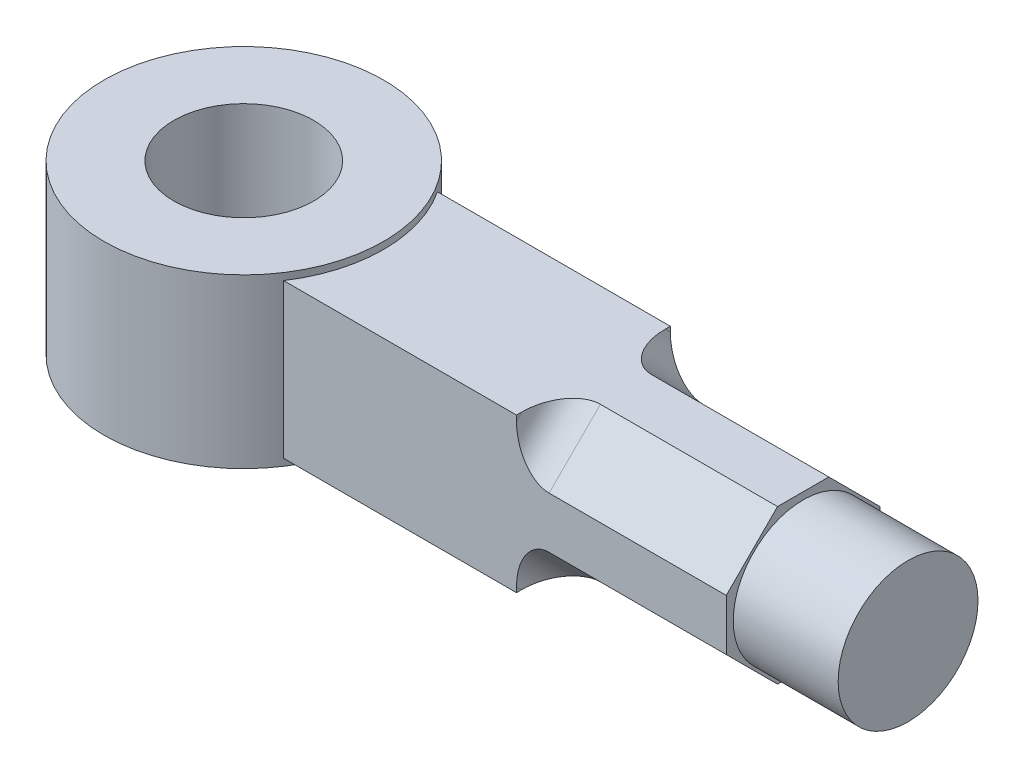
ISO-10303-21;
HEADER;
FILE_DESCRIPTION(('STEP AP214'),'2;1');
FILE_NAME('part.step','',(''),(''),'','','');
FILE_SCHEMA(('AUTOMOTIVE_DESIGN { 1 0 10303 214 1 1 1 1 }'));
ENDSEC;
DATA;
#1=APPLICATION_CONTEXT('core data for automotive mechanical design processes');
#2=APPLICATION_PROTOCOL_DEFINITION('international standard','automotive_design',2000,#1);
#3=PRODUCT_CONTEXT('',#1,'mechanical');
#4=PRODUCT('Part','Part','',(#3));
#5=PRODUCT_RELATED_PRODUCT_CATEGORY('part','',(#4));
#6=PRODUCT_DEFINITION_FORMATION('','',#4);
#7=PRODUCT_DEFINITION_CONTEXT('part definition',#1,'design');
#8=PRODUCT_DEFINITION('design','',#6,#7);
#9=PRODUCT_DEFINITION_SHAPE('','',#8);
#10=(LENGTH_UNIT() NAMED_UNIT(*) SI_UNIT(.MILLI.,.METRE.));
#11=(NAMED_UNIT(*) PLANE_ANGLE_UNIT() SI_UNIT($,.RADIAN.));
#12=(NAMED_UNIT(*) SI_UNIT($,.STERADIAN.) SOLID_ANGLE_UNIT());
#13=UNCERTAINTY_MEASURE_WITH_UNIT(LENGTH_MEASURE(1.E-05),#10,'distance_accuracy_value','');
#14=(GEOMETRIC_REPRESENTATION_CONTEXT(3) GLOBAL_UNCERTAINTY_ASSIGNED_CONTEXT((#13)) GLOBAL_UNIT_ASSIGNED_CONTEXT((#10,
#11,#12)) REPRESENTATION_CONTEXT('',''));
#15=CARTESIAN_POINT('',(0.,0.,0.));
#16=DIRECTION('',(0.,0.,1.));
#17=DIRECTION('',(1.,0.,0.));
#18=AXIS2_PLACEMENT_3D('',#15,#16,#17);
#19=CARTESIAN_POINT('',(0.,-36.,0.));
#20=DIRECTION('',(0.,1.,0.));
#21=DIRECTION('',(0.,0.,1.));
#22=AXIS2_PLACEMENT_3D('',#19,#20,#21);
#23=CYLINDRICAL_SURFACE('',#22,30.);
#24=CARTESIAN_POINT('',(0.,-1.5,0.));
#25=DIRECTION('',(0.,1.,0.));
#26=DIRECTION('',(0.,0.,1.));
#27=AXIS2_PLACEMENT_3D('',#24,#25,#26);
#28=CIRCLE('',#27,30.);
#29=CARTESIAN_POINT('',(25.0549396327351,-1.5,-16.5));
#30=VERTEX_POINT('',#29);
#31=CARTESIAN_POINT('',(25.0549396327351,-1.5,16.5));
#32=VERTEX_POINT('',#31);
#33=EDGE_CURVE('E223',#30,#32,#28,.F.);
#34=ORIENTED_EDGE('',*,*,#33,.F.);
#35=DIRECTION('',(0.,-1.,0.));
#36=VECTOR('',#35,1.);
#37=CARTESIAN_POINT('',(25.0549396327351,-1.5,-16.5));
#38=LINE('',#37,#36);
#39=CARTESIAN_POINT('',(25.0549396327351,-34.5,-16.5));
#40=VERTEX_POINT('',#39);
#41=EDGE_CURVE('E189',#30,#40,#38,.T.);
#42=ORIENTED_EDGE('',*,*,#41,.T.);
#43=CARTESIAN_POINT('',(0.,-34.5,0.));
#44=DIRECTION('',(0.,1.,0.));
#45=DIRECTION('',(0.,0.,1.));
#46=AXIS2_PLACEMENT_3D('',#43,#44,#45);
#47=CIRCLE('',#46,30.);
#48=CARTESIAN_POINT('',(25.0549396327351,-34.5,16.5));
#49=VERTEX_POINT('',#48);
#50=EDGE_CURVE('E216',#40,#49,#47,.F.);
#51=ORIENTED_EDGE('',*,*,#50,.T.);
#52=DIRECTION('',(0.,-1.,0.));
#53=VECTOR('',#52,1.);
#54=CARTESIAN_POINT('',(25.0549396327351,-1.5,16.5));
#55=LINE('',#54,#53);
#56=EDGE_CURVE('E194',#32,#49,#55,.T.);
#57=ORIENTED_EDGE('',*,*,#56,.F.);
#58=EDGE_LOOP('',(#34,#42,#51,#57));
#59=FACE_BOUND('',#58,.T.);
#60=CARTESIAN_POINT('',(0.,-36.,0.));
#61=DIRECTION('',(0.,1.,0.));
#62=DIRECTION('',(0.,0.,1.));
#63=AXIS2_PLACEMENT_3D('',#60,#61,#62);
#64=CIRCLE('',#63,30.);
#65=CARTESIAN_POINT('',(0.,-36.,30.));
#66=VERTEX_POINT('',#65);
#67=EDGE_CURVE('E212',#66,#66,#64,.T.);
#68=ORIENTED_EDGE('',*,*,#67,.T.);
#69=EDGE_LOOP('',(#68));
#70=FACE_BOUND('',#69,.T.);
#71=CARTESIAN_POINT('',(0.,0.,0.));
#72=DIRECTION('',(0.,1.,0.));
#73=DIRECTION('',(0.,0.,1.));
#74=AXIS2_PLACEMENT_3D('',#71,#72,#73);
#75=CIRCLE('',#74,30.);
#76=CARTESIAN_POINT('',(0.,0.,30.));
#77=VERTEX_POINT('',#76);
#78=EDGE_CURVE('E208',#77,#77,#75,.T.);
#79=ORIENTED_EDGE('',*,*,#78,.F.);
#80=EDGE_LOOP('',(#79));
#81=FACE_BOUND('',#80,.T.);
#82=ADVANCED_FACE('F43',(#59,#70,#81),#23,.T.);
#83=CARTESIAN_POINT('',(0.,-36.,0.));
#84=DIRECTION('',(0.,1.,0.));
#85=DIRECTION('',(0.,0.,1.));
#86=AXIS2_PLACEMENT_3D('',#83,#84,#85);
#87=PLANE('',#86);
#88=CARTESIAN_POINT('',(0.,-36.,0.));
#89=DIRECTION('',(0.,1.,0.));
#90=DIRECTION('',(0.,0.,1.));
#91=AXIS2_PLACEMENT_3D('',#88,#89,#90);
#92=CIRCLE('',#91,15.);
#93=CARTESIAN_POINT('',(0.,-36.,15.));
#94=VERTEX_POINT('',#93);
#95=EDGE_CURVE('E204',#94,#94,#92,.T.);
#96=ORIENTED_EDGE('',*,*,#95,.T.);
#97=EDGE_LOOP('',(#96));
#98=FACE_BOUND('',#97,.T.);
#99=ORIENTED_EDGE('',*,*,#67,.F.);
#100=EDGE_LOOP('',(#99));
#101=FACE_BOUND('',#100,.T.);
#102=ADVANCED_FACE('F302',(#98,#101),#87,.F.);
#103=CARTESIAN_POINT('',(0.,0.,0.));
#104=DIRECTION('',(0.,1.,0.));
#105=DIRECTION('',(0.,0.,1.));
#106=AXIS2_PLACEMENT_3D('',#103,#104,#105);
#107=PLANE('',#106);
#108=CARTESIAN_POINT('',(0.,0.,0.));
#109=DIRECTION('',(0.,1.,0.));
#110=DIRECTION('',(0.,0.,1.));
#111=AXIS2_PLACEMENT_3D('',#108,#109,#110);
#112=CIRCLE('',#111,15.);
#113=CARTESIAN_POINT('',(0.,0.,15.));
#114=VERTEX_POINT('',#113);
#115=EDGE_CURVE('E203',#114,#114,#112,.T.);
#116=ORIENTED_EDGE('',*,*,#115,.F.);
#117=EDGE_LOOP('',(#116));
#118=FACE_BOUND('',#117,.T.);
#119=ORIENTED_EDGE('',*,*,#78,.T.);
#120=EDGE_LOOP('',(#119));
#121=FACE_BOUND('',#120,.T.);
#122=ADVANCED_FACE('F308',(#118,#121),#107,.T.);
#123=CARTESIAN_POINT('',(0.,-36.,0.));
#124=DIRECTION('',(0.,1.,0.));
#125=DIRECTION('',(0.,0.,1.));
#126=AXIS2_PLACEMENT_3D('',#123,#124,#125);
#127=CYLINDRICAL_SURFACE('',#126,15.);
#128=ORIENTED_EDGE('',*,*,#95,.F.);
#129=EDGE_LOOP('',(#128));
#130=FACE_BOUND('',#129,.T.);
#131=ORIENTED_EDGE('',*,*,#115,.T.);
#132=EDGE_LOOP('',(#131));
#133=FACE_BOUND('',#132,.T.);
#134=ADVANCED_FACE('F443',(#130,#133),#127,.F.);
#135=CARTESIAN_POINT('',(25.0549396327351,-1.5,16.5));
#136=DIRECTION('',(0.,0.,-1.));
#137=DIRECTION('',(-1.,0.,0.));
#138=AXIS2_PLACEMENT_3D('',#135,#136,#137);
#139=PLANE('',#138);
#140=DIRECTION('',(0.,-1.,0.));
#141=VECTOR('',#140,1.);
#142=CARTESIAN_POINT('',(120.,-1.5,16.5));
#143=LINE('',#142,#141);
#144=CARTESIAN_POINT('',(120.,-12.5000000000001,16.4999999999998));
#145=VERTEX_POINT('',#144);
#146=CARTESIAN_POINT('',(120.,-23.5,16.4999999999996));
#147=VERTEX_POINT('',#146);
#148=EDGE_CURVE('E188',#145,#147,#143,.T.);
#149=ORIENTED_EDGE('',*,*,#148,.F.);
#150=DIRECTION('',(1.,0.,0.));
#151=VECTOR('',#150,1.);
#152=CARTESIAN_POINT('',(75.,-12.5000000000001,16.4999999999998));
#153=LINE('',#152,#151);
#154=CARTESIAN_POINT('',(82.,-12.5000000000001,16.4999999999998));
#155=VERTEX_POINT('',#154);
#156=EDGE_CURVE('E360',#155,#145,#153,.T.);
#157=ORIENTED_EDGE('',*,*,#156,.F.);
#158=CARTESIAN_POINT('',(82.,-2.6005050633888,16.5));
#159=DIRECTION('',(0.,0.,-1.));
#160=DIRECTION('',(0.,1.,0.));
#161=AXIS2_PLACEMENT_3D('',#158,#159,#160);
#162=ELLIPSE('',#161,9.89949493661156,7.);
#163=CARTESIAN_POINT('',(75.,-2.60050506338847,16.4999999999997));
#164=VERTEX_POINT('',#163);
#165=EDGE_CURVE('E267',#155,#164,#162,.T.);
#166=ORIENTED_EDGE('',*,*,#165,.T.);
#167=DIRECTION('',(0.,-1.,0.));
#168=VECTOR('',#167,1.);
#169=CARTESIAN_POINT('',(75.,-1.50000000000014,16.4999999999997));
#170=LINE('',#169,#168);
#171=CARTESIAN_POINT('',(75.,-1.50000000000014,16.4999999999997));
#172=VERTEX_POINT('',#171);
#173=EDGE_CURVE('E359',#172,#164,#170,.T.);
#174=ORIENTED_EDGE('',*,*,#173,.F.);
#175=DIRECTION('',(1.,0.,0.));
#176=VECTOR('',#175,1.);
#177=CARTESIAN_POINT('',(25.0549396327351,-1.5,16.5));
#178=LINE('',#177,#176);
#179=EDGE_CURVE('E382',#32,#172,#178,.T.);
#180=ORIENTED_EDGE('',*,*,#179,.F.);
#181=ORIENTED_EDGE('',*,*,#56,.T.);
#182=DIRECTION('',(1.,0.,0.));
#183=VECTOR('',#182,1.);
#184=CARTESIAN_POINT('',(25.0549396327351,-34.5,16.5));
#185=LINE('',#184,#183);
#186=CARTESIAN_POINT('',(75.,-34.5,16.5));
#187=VERTEX_POINT('',#186);
#188=EDGE_CURVE('E379',#49,#187,#185,.T.);
#189=ORIENTED_EDGE('',*,*,#188,.T.);
#190=DIRECTION('',(0.,-1.,0.));
#191=VECTOR('',#190,1.);
#192=CARTESIAN_POINT('',(75.,-23.5,16.4999999999996));
#193=LINE('',#192,#191);
#194=CARTESIAN_POINT('',(75.,-33.3994949366117,16.4999999999996));
#195=VERTEX_POINT('',#194);
#196=EDGE_CURVE('E350',#195,#187,#193,.T.);
#197=ORIENTED_EDGE('',*,*,#196,.F.);
#198=CARTESIAN_POINT('',(82.,-33.3994949366113,16.5));
#199=DIRECTION('',(0.,0.,-1.));
#200=DIRECTION('',(0.,1.,0.));
#201=AXIS2_PLACEMENT_3D('',#198,#199,#200);
#202=ELLIPSE('',#201,9.89949493661173,7.);
#203=CARTESIAN_POINT('',(82.,-23.5,16.4999999999996));
#204=VERTEX_POINT('',#203);
#205=EDGE_CURVE('E252',#195,#204,#202,.T.);
#206=ORIENTED_EDGE('',*,*,#205,.T.);
#207=DIRECTION('',(1.,0.,0.));
#208=VECTOR('',#207,1.);
#209=CARTESIAN_POINT('',(75.,-23.5,16.4999999999996));
#210=LINE('',#209,#208);
#211=EDGE_CURVE('E339',#204,#147,#210,.T.);
#212=ORIENTED_EDGE('',*,*,#211,.T.);
#213=EDGE_LOOP('',(#149,#157,#166,#174,#180,#181,#189,#197,#206,#212));
#214=FACE_BOUND('',#213,.T.);
#215=ADVANCED_FACE('F408',(#214),#139,.F.);
#216=CARTESIAN_POINT('',(120.,-1.5,-16.5));
#217=DIRECTION('',(-1.,0.,0.));
#218=DIRECTION('',(0.,0.,1.));
#219=AXIS2_PLACEMENT_3D('',#216,#217,#218);
#220=PLANE('',#219);
#221=CARTESIAN_POINT('',(120.,-18.0000000000001,0.));
#222=DIRECTION('',(-1.,0.,0.));
#223=DIRECTION('',(0.,0.,1.));
#224=AXIS2_PLACEMENT_3D('',#221,#222,#223);
#225=CIRCLE('',#224,15.);
#226=CARTESIAN_POINT('',(120.,-18.0000000000001,15.));
#227=VERTEX_POINT('',#226);
#228=EDGE_CURVE('E11',#227,#227,#225,.F.);
#229=ORIENTED_EDGE('',*,*,#228,.F.);
#230=EDGE_LOOP('',(#229));
#231=FACE_BOUND('',#230,.T.);
#232=DIRECTION('',(0.,0.,-1.));
#233=VECTOR('',#232,1.);
#234=CARTESIAN_POINT('',(120.,-1.5,-16.5));
#235=LINE('',#234,#233);
#236=CARTESIAN_POINT('',(120.,-1.50000000000025,5.49999999999967));
#237=VERTEX_POINT('',#236);
#238=CARTESIAN_POINT('',(120.,-1.5,-5.5));
#239=VERTEX_POINT('',#238);
#240=EDGE_CURVE('E386',#237,#239,#235,.T.);
#241=ORIENTED_EDGE('',*,*,#240,.F.);
#242=DIRECTION('',(0.,0.70710678118654,-0.707106781186555));
#243=VECTOR('',#242,1.);
#244=CARTESIAN_POINT('',(120.,-12.5000000000001,16.4999999999998));
#245=LINE('',#244,#243);
#246=EDGE_CURVE('E346',#145,#237,#245,.T.);
#247=ORIENTED_EDGE('',*,*,#246,.F.);
#248=ORIENTED_EDGE('',*,*,#148,.T.);
#249=DIRECTION('',(0.,0.707106781186552,0.707106781186543));
#250=VECTOR('',#249,1.);
#251=CARTESIAN_POINT('',(120.,-34.5000000000001,5.49999999999965));
#252=LINE('',#251,#250);
#253=CARTESIAN_POINT('',(120.,-34.5000000000001,5.49999999999965));
#254=VERTEX_POINT('',#253);
#255=EDGE_CURVE('E169',#254,#147,#252,.T.);
#256=ORIENTED_EDGE('',*,*,#255,.F.);
#257=DIRECTION('',(0.,0.,-1.));
#258=VECTOR('',#257,1.);
#259=CARTESIAN_POINT('',(120.,-34.5,-16.5));
#260=LINE('',#259,#258);
#261=CARTESIAN_POINT('',(120.,-34.4999999999999,-5.50000000000025));
#262=VERTEX_POINT('',#261);
#263=EDGE_CURVE('E179',#254,#262,#260,.T.);
#264=ORIENTED_EDGE('',*,*,#263,.T.);
#265=DIRECTION('',(0.,-0.707106781186545,0.70710678118655));
#266=VECTOR('',#265,1.);
#267=CARTESIAN_POINT('',(120.,-23.4999999999999,-16.5000000000003));
#268=LINE('',#267,#266);
#269=CARTESIAN_POINT('',(120.,-23.4999999999999,-16.5000000000003));
#270=VERTEX_POINT('',#269);
#271=EDGE_CURVE('E161',#270,#262,#268,.T.);
#272=ORIENTED_EDGE('',*,*,#271,.F.);
#273=DIRECTION('',(0.,-1.,0.));
#274=VECTOR('',#273,1.);
#275=CARTESIAN_POINT('',(120.,-1.5,-16.5));
#276=LINE('',#275,#274);
#277=CARTESIAN_POINT('',(120.,-12.5,-16.5));
#278=VERTEX_POINT('',#277);
#279=EDGE_CURVE('E176',#278,#270,#276,.T.);
#280=ORIENTED_EDGE('',*,*,#279,.F.);
#281=DIRECTION('',(0.,-0.707106781186548,-0.707106781186548));
#282=VECTOR('',#281,1.);
#283=CARTESIAN_POINT('',(120.,-1.5,-5.5));
#284=LINE('',#283,#282);
#285=EDGE_CURVE('E181',#239,#278,#284,.T.);
#286=ORIENTED_EDGE('',*,*,#285,.F.);
#287=EDGE_LOOP('',(#241,#247,#248,#256,#264,#272,#280,#286));
#288=FACE_BOUND('',#287,.T.);
#289=ADVANCED_FACE('F174',(#231,#288),#220,.F.);
#290=CARTESIAN_POINT('',(25.0549396327351,-1.5,-16.5));
#291=DIRECTION('',(0.,0.,1.));
#292=DIRECTION('',(1.,0.,0.));
#293=AXIS2_PLACEMENT_3D('',#290,#291,#292);
#294=PLANE('',#293);
#295=ORIENTED_EDGE('',*,*,#279,.T.);
#296=DIRECTION('',(1.,0.,0.));
#297=VECTOR('',#296,1.);
#298=CARTESIAN_POINT('',(75.,-23.4999999999999,-16.5000000000003));
#299=LINE('',#298,#297);
#300=CARTESIAN_POINT('',(82.,-23.4999999999999,-16.5000000000003));
#301=VERTEX_POINT('',#300);
#302=EDGE_CURVE('E157',#301,#270,#299,.T.);
#303=ORIENTED_EDGE('',*,*,#302,.F.);
#304=CARTESIAN_POINT('',(82.,-33.3994949366118,-16.5));
#305=DIRECTION('',(0.,0.,1.));
#306=DIRECTION('',(0.,-1.,0.));
#307=AXIS2_PLACEMENT_3D('',#304,#305,#306);
#308=ELLIPSE('',#307,9.89949493661163,7.);
#309=CARTESIAN_POINT('',(75.,-33.3994949366116,-16.5000000000002));
#310=VERTEX_POINT('',#309);
#311=EDGE_CURVE('E261',#301,#310,#308,.T.);
#312=ORIENTED_EDGE('',*,*,#311,.T.);
#313=DIRECTION('',(0.,1.,0.));
#314=VECTOR('',#313,1.);
#315=CARTESIAN_POINT('',(75.,-34.4999999999999,-16.5000000000002));
#316=LINE('',#315,#314);
#317=CARTESIAN_POINT('',(75.,-34.4999999999999,-16.5000000000002));
#318=VERTEX_POINT('',#317);
#319=EDGE_CURVE('E327',#318,#310,#316,.T.);
#320=ORIENTED_EDGE('',*,*,#319,.F.);
#321=DIRECTION('',(-1.,0.,0.));
#322=VECTOR('',#321,1.);
#323=CARTESIAN_POINT('',(25.0549396327351,-34.5,-16.5));
#324=LINE('',#323,#322);
#325=EDGE_CURVE('E387',#318,#40,#324,.T.);
#326=ORIENTED_EDGE('',*,*,#325,.T.);
#327=ORIENTED_EDGE('',*,*,#41,.F.);
#328=DIRECTION('',(-1.,0.,0.));
#329=VECTOR('',#328,1.);
#330=CARTESIAN_POINT('',(25.0549396327351,-1.5,-16.5));
#331=LINE('',#330,#329);
#332=CARTESIAN_POINT('',(75.,-1.5,-16.5));
#333=VERTEX_POINT('',#332);
#334=EDGE_CURVE('E197',#333,#30,#331,.T.);
#335=ORIENTED_EDGE('',*,*,#334,.F.);
#336=DIRECTION('',(0.,1.,0.));
#337=VECTOR('',#336,1.);
#338=CARTESIAN_POINT('',(75.,-12.5,-16.5));
#339=LINE('',#338,#337);
#340=CARTESIAN_POINT('',(75.,-2.60050506338834,-16.5));
#341=VERTEX_POINT('',#340);
#342=EDGE_CURVE('E286',#341,#333,#339,.T.);
#343=ORIENTED_EDGE('',*,*,#342,.F.);
#344=CARTESIAN_POINT('',(82.,-2.60050506338834,-16.5));
#345=DIRECTION('',(0.,0.,1.));
#346=DIRECTION('',(0.,1.,0.));
#347=AXIS2_PLACEMENT_3D('',#344,#345,#346);
#348=ELLIPSE('',#347,9.89949493661167,7.);
#349=CARTESIAN_POINT('',(82.,-12.5,-16.5));
#350=VERTEX_POINT('',#349);
#351=EDGE_CURVE('E67',#341,#350,#348,.T.);
#352=ORIENTED_EDGE('',*,*,#351,.T.);
#353=DIRECTION('',(1.,0.,0.));
#354=VECTOR('',#353,1.);
#355=CARTESIAN_POINT('',(75.,-12.5,-16.5));
#356=LINE('',#355,#354);
#357=EDGE_CURVE('E185',#350,#278,#356,.T.);
#358=ORIENTED_EDGE('',*,*,#357,.T.);
#359=EDGE_LOOP('',(#295,#303,#312,#320,#326,#327,#335,#343,#352,#358));
#360=FACE_BOUND('',#359,.T.);
#361=ADVANCED_FACE('F184',(#360),#294,.F.);
#362=CARTESIAN_POINT('',(0.,-1.5,0.));
#363=DIRECTION('',(0.,1.,0.));
#364=DIRECTION('',(0.,0.,1.));
#365=AXIS2_PLACEMENT_3D('',#362,#363,#364);
#366=PLANE('',#365);
#367=DIRECTION('',(0.,0.,1.));
#368=VECTOR('',#367,1.);
#369=CARTESIAN_POINT('',(75.,-1.50000000000025,5.49999999999967));
#370=LINE('',#369,#368);
#371=CARTESIAN_POINT('',(75.,-1.50000000000015,15.3994949366113));
#372=VERTEX_POINT('',#371);
#373=EDGE_CURVE('E367',#372,#172,#370,.T.);
#374=ORIENTED_EDGE('',*,*,#373,.F.);
#375=CARTESIAN_POINT('',(82.,-1.5,15.3994949366112));
#376=DIRECTION('',(0.,1.,0.));
#377=DIRECTION('',(0.,0.,-1.));
#378=AXIS2_PLACEMENT_3D('',#375,#376,#377);
#379=ELLIPSE('',#378,9.89949493661177,7.);
#380=CARTESIAN_POINT('',(82.,-1.50000000000025,5.49999999999967));
#381=VERTEX_POINT('',#380);
#382=EDGE_CURVE('E264',#372,#381,#379,.F.);
#383=ORIENTED_EDGE('',*,*,#382,.T.);
#384=DIRECTION('',(1.,0.,0.));
#385=VECTOR('',#384,1.);
#386=CARTESIAN_POINT('',(75.,-1.50000000000025,5.49999999999967));
#387=LINE('',#386,#385);
#388=EDGE_CURVE('E356',#381,#237,#387,.T.);
#389=ORIENTED_EDGE('',*,*,#388,.T.);
#390=ORIENTED_EDGE('',*,*,#240,.T.);
#391=DIRECTION('',(1.,0.,0.));
#392=VECTOR('',#391,1.);
#393=CARTESIAN_POINT('',(75.,-1.5,-5.5));
#394=LINE('',#393,#392);
#395=CARTESIAN_POINT('',(82.,-1.5,-5.5));
#396=VERTEX_POINT('',#395);
#397=EDGE_CURVE('E281',#396,#239,#394,.T.);
#398=ORIENTED_EDGE('',*,*,#397,.F.);
#399=CARTESIAN_POINT('',(82.,-1.5,-15.3994949366117));
#400=DIRECTION('',(0.,1.,0.));
#401=DIRECTION('',(0.,0.,1.));
#402=AXIS2_PLACEMENT_3D('',#399,#400,#401);
#403=ELLIPSE('',#402,9.89949493661167,7.);
#404=CARTESIAN_POINT('',(75.,-1.5,-15.3994949366117));
#405=VERTEX_POINT('',#404);
#406=EDGE_CURVE('E52',#396,#405,#403,.F.);
#407=ORIENTED_EDGE('',*,*,#406,.T.);
#408=DIRECTION('',(0.,0.,1.));
#409=VECTOR('',#408,1.);
#410=CARTESIAN_POINT('',(75.,-1.5,-16.5));
#411=LINE('',#410,#409);
#412=EDGE_CURVE('E278',#333,#405,#411,.T.);
#413=ORIENTED_EDGE('',*,*,#412,.F.);
#414=ORIENTED_EDGE('',*,*,#334,.T.);
#415=ORIENTED_EDGE('',*,*,#33,.T.);
#416=ORIENTED_EDGE('',*,*,#179,.T.);
#417=EDGE_LOOP('',(#374,#383,#389,#390,#398,#407,#413,#414,#415,#416));
#418=FACE_BOUND('',#417,.T.);
#419=ADVANCED_FACE('F277',(#418),#366,.T.);
#420=CARTESIAN_POINT('',(0.,-34.5,0.));
#421=DIRECTION('',(0.,1.,0.));
#422=DIRECTION('',(0.,0.,1.));
#423=AXIS2_PLACEMENT_3D('',#420,#421,#422);
#424=PLANE('',#423);
#425=ORIENTED_EDGE('',*,*,#263,.F.);
#426=DIRECTION('',(1.,0.,0.));
#427=VECTOR('',#426,1.);
#428=CARTESIAN_POINT('',(75.,-34.5000000000001,5.49999999999965));
#429=LINE('',#428,#427);
#430=CARTESIAN_POINT('',(82.,-34.5000000000001,5.49999999999965));
#431=VERTEX_POINT('',#430);
#432=EDGE_CURVE('E343',#431,#254,#429,.T.);
#433=ORIENTED_EDGE('',*,*,#432,.F.);
#434=CARTESIAN_POINT('',(82.,-34.5,15.3994949366113));
#435=DIRECTION('',(0.,1.,0.));
#436=DIRECTION('',(0.,0.,1.));
#437=AXIS2_PLACEMENT_3D('',#434,#435,#436);
#438=ELLIPSE('',#437,9.8994949366116,7.);
#439=CARTESIAN_POINT('',(75.,-34.5,15.3994949366113));
#440=VERTEX_POINT('',#439);
#441=EDGE_CURVE('E255',#431,#440,#438,.T.);
#442=ORIENTED_EDGE('',*,*,#441,.T.);
#443=DIRECTION('',(0.,0.,-1.));
#444=VECTOR('',#443,1.);
#445=CARTESIAN_POINT('',(75.,-34.5,16.4999999999997));
#446=LINE('',#445,#444);
#447=EDGE_CURVE('E342',#187,#440,#446,.T.);
#448=ORIENTED_EDGE('',*,*,#447,.F.);
#449=ORIENTED_EDGE('',*,*,#188,.F.);
#450=ORIENTED_EDGE('',*,*,#50,.F.);
#451=ORIENTED_EDGE('',*,*,#325,.F.);
#452=DIRECTION('',(0.,0.,-1.));
#453=VECTOR('',#452,1.);
#454=CARTESIAN_POINT('',(75.,-34.4999999999999,-5.50000000000025));
#455=LINE('',#454,#453);
#456=CARTESIAN_POINT('',(75.,-34.4999999999999,-15.3994949366119));
#457=VERTEX_POINT('',#456);
#458=EDGE_CURVE('E182',#457,#318,#455,.T.);
#459=ORIENTED_EDGE('',*,*,#458,.F.);
#460=CARTESIAN_POINT('',(82.,-34.5,-15.3994949366118));
#461=DIRECTION('',(0.,1.,0.));
#462=DIRECTION('',(0.,0.,1.));
#463=AXIS2_PLACEMENT_3D('',#460,#461,#462);
#464=ELLIPSE('',#463,9.8994949366117,7.);
#465=CARTESIAN_POINT('',(82.,-34.4999999999999,-5.50000000000025));
#466=VERTEX_POINT('',#465);
#467=EDGE_CURVE('E258',#457,#466,#464,.T.);
#468=ORIENTED_EDGE('',*,*,#467,.T.);
#469=DIRECTION('',(1.,0.,0.));
#470=VECTOR('',#469,1.);
#471=CARTESIAN_POINT('',(75.,-34.4999999999999,-5.50000000000025));
#472=LINE('',#471,#470);
#473=EDGE_CURVE('E168',#466,#262,#472,.T.);
#474=ORIENTED_EDGE('',*,*,#473,.T.);
#475=EDGE_LOOP('',(#425,#433,#442,#448,#449,#450,#451,#459,#468,#474));
#476=FACE_BOUND('',#475,.T.);
#477=ADVANCED_FACE('F401',(#476),#424,.F.);
#478=CARTESIAN_POINT('',(75.,-23.4999999999999,-16.5000000000003));
#479=DIRECTION('',(0.,0.70710678118655,0.707106781186545));
#480=DIRECTION('',(0.,-0.707106781186545,0.70710678118655));
#481=AXIS2_PLACEMENT_3D('',#478,#479,#480);
#482=PLANE('',#481);
#483=ORIENTED_EDGE('',*,*,#473,.F.);
#484=DIRECTION('',(0.,-0.707106781186545,0.70710678118655));
#485=VECTOR('',#484,1.);
#486=CARTESIAN_POINT('',(82.,-23.4999999999999,-16.5000000000003));
#487=LINE('',#486,#485);
#488=EDGE_CURVE('E164',#466,#301,#487,.F.);
#489=ORIENTED_EDGE('',*,*,#488,.T.);
#490=ORIENTED_EDGE('',*,*,#302,.T.);
#491=ORIENTED_EDGE('',*,*,#271,.T.);
#492=EDGE_LOOP('',(#483,#489,#490,#491));
#493=FACE_BOUND('',#492,.T.);
#494=ADVANCED_FACE('F160',(#493),#482,.F.);
#495=CARTESIAN_POINT('',(75.,0.,0.));
#496=DIRECTION('',(1.,0.,0.));
#497=DIRECTION('',(0.,0.,-1.));
#498=AXIS2_PLACEMENT_3D('',#495,#496,#497);
#499=PLANE('',#498);
#500=ORIENTED_EDGE('',*,*,#319,.T.);
#501=DIRECTION('',(0.,-0.707106781186545,0.70710678118655));
#502=VECTOR('',#501,1.);
#503=CARTESIAN_POINT('',(75.,-24.949747468306,-24.9497474683059));
#504=LINE('',#503,#502);
#505=EDGE_CURVE('E233',#310,#457,#504,.T.);
#506=ORIENTED_EDGE('',*,*,#505,.T.);
#507=ORIENTED_EDGE('',*,*,#458,.T.);
#508=EDGE_LOOP('',(#500,#506,#507));
#509=FACE_BOUND('',#508,.T.);
#510=ADVANCED_FACE('F330',(#509),#499,.T.);
#511=CARTESIAN_POINT('',(75.,-34.5000000000001,5.49999999999965));
#512=DIRECTION('',(0.,0.707106781186543,-0.707106781186552));
#513=DIRECTION('',(0.,0.707106781186552,0.707106781186543));
#514=AXIS2_PLACEMENT_3D('',#511,#512,#513);
#515=PLANE('',#514);
#516=ORIENTED_EDGE('',*,*,#211,.F.);
#517=DIRECTION('',(0.,0.707106781186552,0.707106781186543));
#518=VECTOR('',#517,1.);
#519=CARTESIAN_POINT('',(82.,-34.5000000000001,5.49999999999965));
#520=LINE('',#519,#518);
#521=EDGE_CURVE('E230',#204,#431,#520,.F.);
#522=ORIENTED_EDGE('',*,*,#521,.T.);
#523=ORIENTED_EDGE('',*,*,#432,.T.);
#524=ORIENTED_EDGE('',*,*,#255,.T.);
#525=EDGE_LOOP('',(#516,#522,#523,#524));
#526=FACE_BOUND('',#525,.T.);
#527=ADVANCED_FACE('F427',(#526),#515,.F.);
#528=CARTESIAN_POINT('',(75.,0.,0.));
#529=DIRECTION('',(1.,0.,0.));
#530=DIRECTION('',(0.,0.,-1.));
#531=AXIS2_PLACEMENT_3D('',#528,#529,#530);
#532=PLANE('',#531);
#533=ORIENTED_EDGE('',*,*,#447,.T.);
#534=DIRECTION('',(0.,0.707106781186552,0.707106781186543));
#535=VECTOR('',#534,1.);
#536=CARTESIAN_POINT('',(75.,-24.9497474683054,24.9497474683058));
#537=LINE('',#536,#535);
#538=EDGE_CURVE('E226',#440,#195,#537,.T.);
#539=ORIENTED_EDGE('',*,*,#538,.T.);
#540=ORIENTED_EDGE('',*,*,#196,.T.);
#541=EDGE_LOOP('',(#533,#539,#540));
#542=FACE_BOUND('',#541,.T.);
#543=ADVANCED_FACE('F420',(#542),#532,.T.);
#544=CARTESIAN_POINT('',(75.,-1.5,-5.5));
#545=DIRECTION('',(0.,-0.707106781186547,0.707106781186547));
#546=DIRECTION('',(0.,-0.707106781186548,-0.707106781186548));
#547=AXIS2_PLACEMENT_3D('',#544,#545,#546);
#548=PLANE('',#547);
#549=ORIENTED_EDGE('',*,*,#357,.F.);
#550=DIRECTION('',(0.,-0.707106781186548,-0.707106781186548));
#551=VECTOR('',#550,1.);
#552=CARTESIAN_POINT('',(82.,-1.5,-5.5));
#553=LINE('',#552,#551);
#554=EDGE_CURVE('E59',#350,#396,#553,.F.);
#555=ORIENTED_EDGE('',*,*,#554,.T.);
#556=ORIENTED_EDGE('',*,*,#397,.T.);
#557=ORIENTED_EDGE('',*,*,#285,.T.);
#558=EDGE_LOOP('',(#549,#555,#556,#557));
#559=FACE_BOUND('',#558,.T.);
#560=ADVANCED_FACE('F418',(#559),#548,.F.);
#561=CARTESIAN_POINT('',(75.,0.,0.));
#562=DIRECTION('',(-1.,0.,0.));
#563=DIRECTION('',(0.,0.,1.));
#564=AXIS2_PLACEMENT_3D('',#561,#562,#563);
#565=PLANE('',#564);
#566=ORIENTED_EDGE('',*,*,#412,.T.);
#567=DIRECTION('',(0.,-0.707106781186548,-0.707106781186548));
#568=VECTOR('',#567,1.);
#569=CARTESIAN_POINT('',(75.,-7.55025253169417,-21.4497474683058));
#570=LINE('',#569,#568);
#571=EDGE_CURVE('E246',#405,#341,#570,.T.);
#572=ORIENTED_EDGE('',*,*,#571,.T.);
#573=ORIENTED_EDGE('',*,*,#342,.T.);
#574=EDGE_LOOP('',(#566,#572,#573));
#575=FACE_BOUND('',#574,.T.);
#576=ADVANCED_FACE('F285',(#575),#565,.F.);
#577=CARTESIAN_POINT('',(75.,-12.5000000000001,16.4999999999998));
#578=DIRECTION('',(0.,-0.707106781186555,-0.70710678118654));
#579=DIRECTION('',(0.,0.70710678118654,-0.707106781186555));
#580=AXIS2_PLACEMENT_3D('',#577,#578,#579);
#581=PLANE('',#580);
#582=ORIENTED_EDGE('',*,*,#388,.F.);
#583=DIRECTION('',(0.,0.70710678118654,-0.707106781186555));
#584=VECTOR('',#583,1.);
#585=CARTESIAN_POINT('',(82.,-12.5000000000001,16.4999999999998));
#586=LINE('',#585,#584);
#587=EDGE_CURVE('E243',#381,#155,#586,.F.);
#588=ORIENTED_EDGE('',*,*,#587,.T.);
#589=ORIENTED_EDGE('',*,*,#156,.T.);
#590=ORIENTED_EDGE('',*,*,#246,.T.);
#591=EDGE_LOOP('',(#582,#588,#589,#590));
#592=FACE_BOUND('',#591,.T.);
#593=ADVANCED_FACE('F416',(#592),#581,.F.);
#594=CARTESIAN_POINT('',(75.,0.,0.));
#595=DIRECTION('',(1.,0.,0.));
#596=DIRECTION('',(0.,0.,-1.));
#597=AXIS2_PLACEMENT_3D('',#594,#595,#596);
#598=PLANE('',#597);
#599=ORIENTED_EDGE('',*,*,#173,.T.);
#600=DIRECTION('',(0.,0.70710678118654,-0.707106781186555));
#601=VECTOR('',#600,1.);
#602=CARTESIAN_POINT('',(75.,6.94974746830558,6.94974746830543));
#603=LINE('',#602,#601);
#604=EDGE_CURVE('E239',#164,#372,#603,.T.);
#605=ORIENTED_EDGE('',*,*,#604,.T.);
#606=ORIENTED_EDGE('',*,*,#373,.T.);
#607=EDGE_LOOP('',(#599,#605,#606));
#608=FACE_BOUND('',#607,.T.);
#609=ADVANCED_FACE('F318',(#608),#598,.T.);
#610=CARTESIAN_POINT('',(82.,-24.9497474683054,24.9497474683058));
#611=DIRECTION('',(0.,0.707106781186552,0.707106781186543));
#612=DIRECTION('',(0.,-0.707106781186543,0.707106781186552));
#613=AXIS2_PLACEMENT_3D('',#610,#611,#612);
#614=CYLINDRICAL_SURFACE('',#613,7.);
#615=ORIENTED_EDGE('',*,*,#441,.F.);
#616=ORIENTED_EDGE('',*,*,#521,.F.);
#617=ORIENTED_EDGE('',*,*,#205,.F.);
#618=ORIENTED_EDGE('',*,*,#538,.F.);
#619=EDGE_LOOP('',(#615,#616,#617,#618));
#620=FACE_BOUND('',#619,.T.);
#621=ADVANCED_FACE('F315',(#620),#614,.F.);
#622=CARTESIAN_POINT('',(82.,-24.949747468306,-24.9497474683059));
#623=DIRECTION('',(0.,-0.707106781186545,0.70710678118655));
#624=DIRECTION('',(0.,-0.70710678118655,-0.707106781186545));
#625=AXIS2_PLACEMENT_3D('',#622,#623,#624);
#626=CYLINDRICAL_SURFACE('',#625,7.);
#627=ORIENTED_EDGE('',*,*,#311,.F.);
#628=ORIENTED_EDGE('',*,*,#488,.F.);
#629=ORIENTED_EDGE('',*,*,#467,.F.);
#630=ORIENTED_EDGE('',*,*,#505,.F.);
#631=EDGE_LOOP('',(#627,#628,#629,#630));
#632=FACE_BOUND('',#631,.T.);
#633=ADVANCED_FACE('F299',(#632),#626,.F.);
#634=CARTESIAN_POINT('',(82.,6.94974746830558,6.94974746830543));
#635=DIRECTION('',(0.,0.70710678118654,-0.707106781186555));
#636=DIRECTION('',(0.,0.707106781186555,0.70710678118654));
#637=AXIS2_PLACEMENT_3D('',#634,#635,#636);
#638=CYLINDRICAL_SURFACE('',#637,7.);
#639=ORIENTED_EDGE('',*,*,#165,.F.);
#640=ORIENTED_EDGE('',*,*,#587,.F.);
#641=ORIENTED_EDGE('',*,*,#382,.F.);
#642=ORIENTED_EDGE('',*,*,#604,.F.);
#643=EDGE_LOOP('',(#639,#640,#641,#642));
#644=FACE_BOUND('',#643,.T.);
#645=ADVANCED_FACE('F291',(#644),#638,.F.);
#646=CARTESIAN_POINT('',(82.,6.94974746830583,-6.94974746830583));
#647=DIRECTION('',(0.,0.707106781186548,0.707106781186548));
#648=DIRECTION('',(0.,-0.707106781186548,0.707106781186548));
#649=AXIS2_PLACEMENT_3D('',#646,#647,#648);
#650=CYLINDRICAL_SURFACE('',#649,7.);
#651=ORIENTED_EDGE('',*,*,#406,.F.);
#652=ORIENTED_EDGE('',*,*,#554,.F.);
#653=ORIENTED_EDGE('',*,*,#351,.F.);
#654=ORIENTED_EDGE('',*,*,#571,.F.);
#655=EDGE_LOOP('',(#651,#652,#653,#654));
#656=FACE_BOUND('',#655,.T.);
#657=ADVANCED_FACE('F45',(#656),#650,.F.);
#658=CARTESIAN_POINT('',(142.5,-18.0000000000001,0.));
#659=DIRECTION('',(-1.,0.,0.));
#660=DIRECTION('',(0.,0.,1.));
#661=AXIS2_PLACEMENT_3D('',#658,#659,#660);
#662=CYLINDRICAL_SURFACE('',#661,15.);
#663=CARTESIAN_POINT('',(142.5,-18.0000000000001,0.));
#664=DIRECTION('',(1.,0.,0.));
#665=DIRECTION('',(0.,0.,-1.));
#666=AXIS2_PLACEMENT_3D('',#663,#664,#665);
#667=CIRCLE('',#666,15.);
#668=CARTESIAN_POINT('',(142.5,-18.0000000000001,-15.));
#669=VERTEX_POINT('',#668);
#670=EDGE_CURVE('E363',#669,#669,#667,.T.);
#671=ORIENTED_EDGE('',*,*,#670,.F.);
#672=EDGE_LOOP('',(#671));
#673=FACE_BOUND('',#672,.T.);
#674=ORIENTED_EDGE('',*,*,#228,.T.);
#675=EDGE_LOOP('',(#674));
#676=FACE_BOUND('',#675,.T.);
#677=ADVANCED_FACE('F290',(#673,#676),#662,.T.);
#678=CARTESIAN_POINT('',(142.5,-18.0000000000001,0.));
#679=DIRECTION('',(1.,0.,0.));
#680=DIRECTION('',(0.,0.,-1.));
#681=AXIS2_PLACEMENT_3D('',#678,#679,#680);
#682=PLANE('',#681);
#683=ORIENTED_EDGE('',*,*,#670,.T.);
#684=EDGE_LOOP('',(#683));
#685=FACE_BOUND('',#684,.T.);
#686=ADVANCED_FACE('F296',(#685),#682,.T.);
#687=CLOSED_SHELL('',(#82,#102,#122,#134,#215,#289,#361,#419,#477,#494,#510,#527,#543,#560,#576,
#593,#609,#621,#633,#645,#657,#677,#686));
#688=MANIFOLD_SOLID_BREP('B2',#687);
#689=ADVANCED_BREP_SHAPE_REPRESENTATION('',(#18,#688),#14);
#690=SHAPE_DEFINITION_REPRESENTATION(#9,#689);
ENDSEC;
END-ISO-10303-21;
